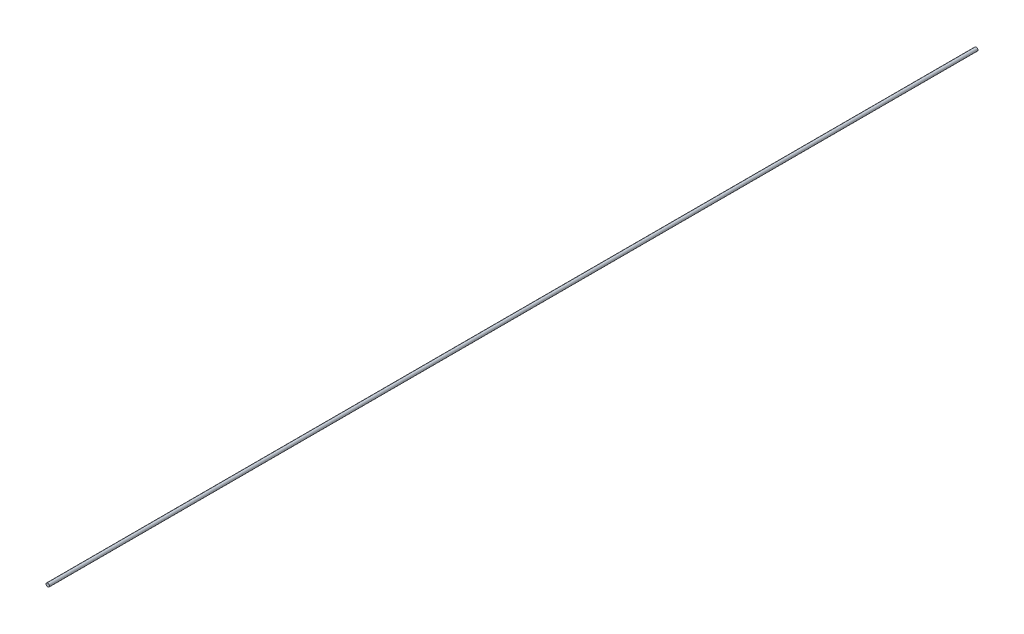
ISO-10303-21;
HEADER;
FILE_DESCRIPTION(('STEP AP214'),'2;1');
FILE_NAME('part.step','',(''),(''),'','','');
FILE_SCHEMA(('AUTOMOTIVE_DESIGN { 1 0 10303 214 1 1 1 1 }'));
ENDSEC;
DATA;
#1=APPLICATION_CONTEXT('core data for automotive mechanical design processes');
#2=APPLICATION_PROTOCOL_DEFINITION('international standard','automotive_design',2000,#1);
#3=PRODUCT_CONTEXT('',#1,'mechanical');
#4=PRODUCT('Part','Part','',(#3));
#5=PRODUCT_RELATED_PRODUCT_CATEGORY('part','',(#4));
#6=PRODUCT_DEFINITION_FORMATION('','',#4);
#7=PRODUCT_DEFINITION_CONTEXT('part definition',#1,'design');
#8=PRODUCT_DEFINITION('design','',#6,#7);
#9=PRODUCT_DEFINITION_SHAPE('','',#8);
#10=(LENGTH_UNIT() NAMED_UNIT(*) SI_UNIT(.MILLI.,.METRE.));
#11=(NAMED_UNIT(*) PLANE_ANGLE_UNIT() SI_UNIT($,.RADIAN.));
#12=(NAMED_UNIT(*) SI_UNIT($,.STERADIAN.) SOLID_ANGLE_UNIT());
#13=UNCERTAINTY_MEASURE_WITH_UNIT(LENGTH_MEASURE(1.E-05),#10,'distance_accuracy_value','');
#14=(GEOMETRIC_REPRESENTATION_CONTEXT(3) GLOBAL_UNCERTAINTY_ASSIGNED_CONTEXT((#13)) GLOBAL_UNIT_ASSIGNED_CONTEXT((#10,
#11,#12)) REPRESENTATION_CONTEXT('',''));
#15=CARTESIAN_POINT('',(0.,0.,0.));
#16=DIRECTION('',(0.,0.,1.));
#17=DIRECTION('',(1.,0.,0.));
#18=AXIS2_PLACEMENT_3D('',#15,#16,#17);
#19=CARTESIAN_POINT('',(0.,0.,270.));
#20=DIRECTION('',(0.,0.,-1.));
#21=DIRECTION('',(-1.,0.,0.));
#22=AXIS2_PLACEMENT_3D('',#19,#20,#21);
#23=CYLINDRICAL_SURFACE('',#22,0.5);
#24=CARTESIAN_POINT('',(0.,0.,270.));
#25=DIRECTION('',(0.,0.,1.));
#26=DIRECTION('',(1.,0.,0.));
#27=AXIS2_PLACEMENT_3D('',#24,#25,#26);
#28=CIRCLE('',#27,0.5);
#29=CARTESIAN_POINT('',(0.5,0.,270.));
#30=VERTEX_POINT('',#29);
#31=EDGE_CURVE('E10',#30,#30,#28,.T.);
#32=ORIENTED_EDGE('',*,*,#31,.F.);
#33=EDGE_LOOP('',(#32));
#34=FACE_BOUND('',#33,.T.);
#35=CARTESIAN_POINT('',(0.,0.,0.));
#36=DIRECTION('',(0.,0.,1.));
#37=DIRECTION('',(1.,0.,0.));
#38=AXIS2_PLACEMENT_3D('',#35,#36,#37);
#39=CIRCLE('',#38,0.5);
#40=CARTESIAN_POINT('',(0.5,0.,0.));
#41=VERTEX_POINT('',#40);
#42=EDGE_CURVE('E36',#41,#41,#39,.T.);
#43=ORIENTED_EDGE('',*,*,#42,.T.);
#44=EDGE_LOOP('',(#43));
#45=FACE_BOUND('',#44,.T.);
#46=ADVANCED_FACE('F33',(#34,#45),#23,.T.);
#47=CARTESIAN_POINT('',(0.,0.,270.));
#48=DIRECTION('',(0.,0.,1.));
#49=DIRECTION('',(1.,0.,0.));
#50=AXIS2_PLACEMENT_3D('',#47,#48,#49);
#51=PLANE('',#50);
#52=ORIENTED_EDGE('',*,*,#31,.T.);
#53=EDGE_LOOP('',(#52));
#54=FACE_BOUND('',#53,.T.);
#55=ADVANCED_FACE('F48',(#54),#51,.T.);
#56=CARTESIAN_POINT('',(0.,0.,0.));
#57=DIRECTION('',(0.,0.,1.));
#58=DIRECTION('',(1.,0.,0.));
#59=AXIS2_PLACEMENT_3D('',#56,#57,#58);
#60=PLANE('',#59);
#61=ORIENTED_EDGE('',*,*,#42,.F.);
#62=EDGE_LOOP('',(#61));
#63=FACE_BOUND('',#62,.T.);
#64=ADVANCED_FACE('F46',(#63),#60,.F.);
#65=CLOSED_SHELL('',(#46,#55,#64));
#66=MANIFOLD_SOLID_BREP('B2',#65);
#67=ADVANCED_BREP_SHAPE_REPRESENTATION('',(#18,#66),#14);
#68=SHAPE_DEFINITION_REPRESENTATION(#9,#67);
ENDSEC;
END-ISO-10303-21;
